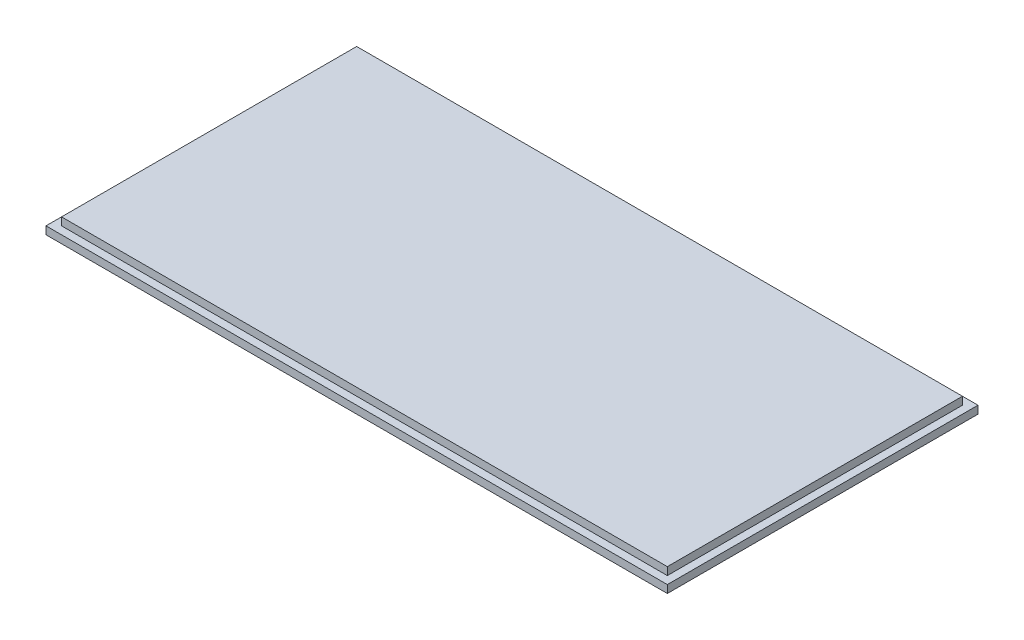
ISO-10303-21;
HEADER;
FILE_DESCRIPTION(('STEP AP214'),'2;1');
FILE_NAME('part.step','',(''),(''),'','','');
FILE_SCHEMA(('AUTOMOTIVE_DESIGN { 1 0 10303 214 1 1 1 1 }'));
ENDSEC;
DATA;
#1=APPLICATION_CONTEXT('core data for automotive mechanical design processes');
#2=APPLICATION_PROTOCOL_DEFINITION('international standard','automotive_design',2000,#1);
#3=PRODUCT_CONTEXT('',#1,'mechanical');
#4=PRODUCT('Part','Part','',(#3));
#5=PRODUCT_RELATED_PRODUCT_CATEGORY('part','',(#4));
#6=PRODUCT_DEFINITION_FORMATION('','',#4);
#7=PRODUCT_DEFINITION_CONTEXT('part definition',#1,'design');
#8=PRODUCT_DEFINITION('design','',#6,#7);
#9=PRODUCT_DEFINITION_SHAPE('','',#8);
#10=(LENGTH_UNIT() NAMED_UNIT(*) SI_UNIT(.MILLI.,.METRE.));
#11=(NAMED_UNIT(*) PLANE_ANGLE_UNIT() SI_UNIT($,.RADIAN.));
#12=(NAMED_UNIT(*) SI_UNIT($,.STERADIAN.) SOLID_ANGLE_UNIT());
#13=UNCERTAINTY_MEASURE_WITH_UNIT(LENGTH_MEASURE(1.E-05),#10,'distance_accuracy_value','');
#14=(GEOMETRIC_REPRESENTATION_CONTEXT(3) GLOBAL_UNCERTAINTY_ASSIGNED_CONTEXT((#13)) GLOBAL_UNIT_ASSIGNED_CONTEXT((#10,
#11,#12)) REPRESENTATION_CONTEXT('',''));
#15=CARTESIAN_POINT('',(0.,0.,0.));
#16=DIRECTION('',(0.,0.,1.));
#17=DIRECTION('',(1.,0.,0.));
#18=AXIS2_PLACEMENT_3D('',#15,#16,#17);
#19=CARTESIAN_POINT('',(60.,3.,-30.));
#20=DIRECTION('',(-1.,0.,0.));
#21=DIRECTION('',(0.,0.,1.));
#22=AXIS2_PLACEMENT_3D('',#19,#20,#21);
#23=PLANE('',#22);
#24=DIRECTION('',(0.,0.,-1.));
#25=VECTOR('',#24,1.);
#26=CARTESIAN_POINT('',(60.,1.5,-30.));
#27=LINE('',#26,#25);
#28=CARTESIAN_POINT('',(60.,1.5,30.));
#29=VERTEX_POINT('',#28);
#30=CARTESIAN_POINT('',(60.,1.5,-30.));
#31=VERTEX_POINT('',#30);
#32=EDGE_CURVE('E160',#29,#31,#27,.T.);
#33=ORIENTED_EDGE('',*,*,#32,.F.);
#34=DIRECTION('',(0.,-1.,0.));
#35=VECTOR('',#34,1.);
#36=CARTESIAN_POINT('',(60.,3.,30.));
#37=LINE('',#36,#35);
#38=CARTESIAN_POINT('',(60.,0.,30.));
#39=VERTEX_POINT('',#38);
#40=EDGE_CURVE('E179',#29,#39,#37,.T.);
#41=ORIENTED_EDGE('',*,*,#40,.T.);
#42=DIRECTION('',(0.,0.,-1.));
#43=VECTOR('',#42,1.);
#44=CARTESIAN_POINT('',(60.,0.,-30.));
#45=LINE('',#44,#43);
#46=CARTESIAN_POINT('',(60.,0.,-30.));
#47=VERTEX_POINT('',#46);
#48=EDGE_CURVE('E163',#39,#47,#45,.T.);
#49=ORIENTED_EDGE('',*,*,#48,.T.);
#50=DIRECTION('',(0.,-1.,0.));
#51=VECTOR('',#50,1.);
#52=CARTESIAN_POINT('',(60.,3.,-30.));
#53=LINE('',#52,#51);
#54=EDGE_CURVE('E47',#31,#47,#53,.T.);
#55=ORIENTED_EDGE('',*,*,#54,.F.);
#56=EDGE_LOOP('',(#33,#41,#49,#55));
#57=FACE_BOUND('',#56,.T.);
#58=ADVANCED_FACE('F39',(#57),#23,.F.);
#59=CARTESIAN_POINT('',(-60.,3.,-30.));
#60=DIRECTION('',(0.,0.,1.));
#61=DIRECTION('',(1.,0.,0.));
#62=AXIS2_PLACEMENT_3D('',#59,#60,#61);
#63=PLANE('',#62);
#64=DIRECTION('',(-1.,0.,0.));
#65=VECTOR('',#64,1.);
#66=CARTESIAN_POINT('',(-60.,1.5,-30.));
#67=LINE('',#66,#65);
#68=CARTESIAN_POINT('',(-60.,1.5,-30.));
#69=VERTEX_POINT('',#68);
#70=EDGE_CURVE('E157',#31,#69,#67,.T.);
#71=ORIENTED_EDGE('',*,*,#70,.F.);
#72=ORIENTED_EDGE('',*,*,#54,.T.);
#73=DIRECTION('',(-1.,0.,0.));
#74=VECTOR('',#73,1.);
#75=CARTESIAN_POINT('',(-60.,0.,-30.));
#76=LINE('',#75,#74);
#77=CARTESIAN_POINT('',(-60.,0.,-30.));
#78=VERTEX_POINT('',#77);
#79=EDGE_CURVE('E167',#47,#78,#76,.T.);
#80=ORIENTED_EDGE('',*,*,#79,.T.);
#81=DIRECTION('',(0.,-1.,0.));
#82=VECTOR('',#81,1.);
#83=CARTESIAN_POINT('',(-60.,3.,-30.));
#84=LINE('',#83,#82);
#85=EDGE_CURVE('E185',#69,#78,#84,.T.);
#86=ORIENTED_EDGE('',*,*,#85,.F.);
#87=EDGE_LOOP('',(#71,#72,#80,#86));
#88=FACE_BOUND('',#87,.T.);
#89=ADVANCED_FACE('F192',(#88),#63,.F.);
#90=CARTESIAN_POINT('',(-60.,3.,-30.));
#91=DIRECTION('',(1.,0.,0.));
#92=DIRECTION('',(0.,0.,-1.));
#93=AXIS2_PLACEMENT_3D('',#90,#91,#92);
#94=PLANE('',#93);
#95=DIRECTION('',(0.,0.,1.));
#96=VECTOR('',#95,1.);
#97=CARTESIAN_POINT('',(-60.,1.5,-30.));
#98=LINE('',#97,#96);
#99=CARTESIAN_POINT('',(-60.,1.5,30.));
#100=VERTEX_POINT('',#99);
#101=EDGE_CURVE('E53',#69,#100,#98,.T.);
#102=ORIENTED_EDGE('',*,*,#101,.F.);
#103=ORIENTED_EDGE('',*,*,#85,.T.);
#104=DIRECTION('',(0.,0.,1.));
#105=VECTOR('',#104,1.);
#106=CARTESIAN_POINT('',(-60.,0.,-30.));
#107=LINE('',#106,#105);
#108=CARTESIAN_POINT('',(-60.,0.,30.));
#109=VERTEX_POINT('',#108);
#110=EDGE_CURVE('E171',#78,#109,#107,.T.);
#111=ORIENTED_EDGE('',*,*,#110,.T.);
#112=DIRECTION('',(0.,-1.,0.));
#113=VECTOR('',#112,1.);
#114=CARTESIAN_POINT('',(-60.,3.,30.));
#115=LINE('',#114,#113);
#116=EDGE_CURVE('E182',#100,#109,#115,.T.);
#117=ORIENTED_EDGE('',*,*,#116,.F.);
#118=EDGE_LOOP('',(#102,#103,#111,#117));
#119=FACE_BOUND('',#118,.T.);
#120=ADVANCED_FACE('F206',(#119),#94,.F.);
#121=CARTESIAN_POINT('',(-60.,3.,30.));
#122=DIRECTION('',(0.,0.,-1.));
#123=DIRECTION('',(-1.,0.,0.));
#124=AXIS2_PLACEMENT_3D('',#121,#122,#123);
#125=PLANE('',#124);
#126=DIRECTION('',(1.,0.,0.));
#127=VECTOR('',#126,1.);
#128=CARTESIAN_POINT('',(-60.,1.5,30.));
#129=LINE('',#128,#127);
#130=EDGE_CURVE('E12',#100,#29,#129,.T.);
#131=ORIENTED_EDGE('',*,*,#130,.F.);
#132=ORIENTED_EDGE('',*,*,#116,.T.);
#133=DIRECTION('',(1.,0.,0.));
#134=VECTOR('',#133,1.);
#135=CARTESIAN_POINT('',(-60.,0.,30.));
#136=LINE('',#135,#134);
#137=EDGE_CURVE('E175',#109,#39,#136,.T.);
#138=ORIENTED_EDGE('',*,*,#137,.T.);
#139=ORIENTED_EDGE('',*,*,#40,.F.);
#140=EDGE_LOOP('',(#131,#132,#138,#139));
#141=FACE_BOUND('',#140,.T.);
#142=ADVANCED_FACE('F203',(#141),#125,.F.);
#143=CARTESIAN_POINT('',(0.,0.,0.));
#144=DIRECTION('',(0.,1.,0.));
#145=DIRECTION('',(0.,0.,1.));
#146=AXIS2_PLACEMENT_3D('',#143,#144,#145);
#147=PLANE('',#146);
#148=ORIENTED_EDGE('',*,*,#48,.F.);
#149=ORIENTED_EDGE('',*,*,#137,.F.);
#150=ORIENTED_EDGE('',*,*,#110,.F.);
#151=ORIENTED_EDGE('',*,*,#79,.F.);
#152=EDGE_LOOP('',(#148,#149,#150,#151));
#153=FACE_BOUND('',#152,.T.);
#154=ADVANCED_FACE('F199',(#153),#147,.F.);
#155=CARTESIAN_POINT('',(0.,1.5,0.));
#156=DIRECTION('',(0.,1.,0.));
#157=DIRECTION('',(0.,0.,1.));
#158=AXIS2_PLACEMENT_3D('',#155,#156,#157);
#159=PLANE('',#158);
#160=DIRECTION('',(1.,0.,0.));
#161=VECTOR('',#160,1.);
#162=CARTESIAN_POINT('',(-58.5,1.5,28.5));
#163=LINE('',#162,#161);
#164=CARTESIAN_POINT('',(-58.5,1.5,28.5));
#165=VERTEX_POINT('',#164);
#166=CARTESIAN_POINT('',(58.5,1.5,28.5));
#167=VERTEX_POINT('',#166);
#168=EDGE_CURVE('E116',#165,#167,#163,.T.);
#169=ORIENTED_EDGE('',*,*,#168,.F.);
#170=DIRECTION('',(0.,0.,1.));
#171=VECTOR('',#170,1.);
#172=CARTESIAN_POINT('',(-58.5,1.5,-28.5));
#173=LINE('',#172,#171);
#174=CARTESIAN_POINT('',(-58.5,1.5,-28.5));
#175=VERTEX_POINT('',#174);
#176=EDGE_CURVE('E125',#175,#165,#173,.T.);
#177=ORIENTED_EDGE('',*,*,#176,.F.);
#178=DIRECTION('',(-1.,0.,0.));
#179=VECTOR('',#178,1.);
#180=CARTESIAN_POINT('',(-58.5,1.5,-28.5));
#181=LINE('',#180,#179);
#182=CARTESIAN_POINT('',(58.5,1.5,-28.5));
#183=VERTEX_POINT('',#182);
#184=EDGE_CURVE('E107',#183,#175,#181,.T.);
#185=ORIENTED_EDGE('',*,*,#184,.F.);
#186=DIRECTION('',(0.,0.,-1.));
#187=VECTOR('',#186,1.);
#188=CARTESIAN_POINT('',(58.5,1.5,-28.5));
#189=LINE('',#188,#187);
#190=EDGE_CURVE('E122',#167,#183,#189,.T.);
#191=ORIENTED_EDGE('',*,*,#190,.F.);
#192=EDGE_LOOP('',(#169,#177,#185,#191));
#193=FACE_BOUND('',#192,.T.);
#194=ORIENTED_EDGE('',*,*,#32,.T.);
#195=ORIENTED_EDGE('',*,*,#70,.T.);
#196=ORIENTED_EDGE('',*,*,#101,.T.);
#197=ORIENTED_EDGE('',*,*,#130,.T.);
#198=EDGE_LOOP('',(#194,#195,#196,#197));
#199=FACE_BOUND('',#198,.T.);
#200=ADVANCED_FACE('F121',(#193,#199),#159,.T.);
#201=CARTESIAN_POINT('',(58.5,1.5,-28.5));
#202=DIRECTION('',(1.,0.,0.));
#203=DIRECTION('',(0.,0.,-1.));
#204=AXIS2_PLACEMENT_3D('',#201,#202,#203);
#205=PLANE('',#204);
#206=DIRECTION('',(0.,0.,-1.));
#207=VECTOR('',#206,1.);
#208=CARTESIAN_POINT('',(58.5,3.,-28.5));
#209=LINE('',#208,#207);
#210=CARTESIAN_POINT('',(58.5,3.,28.5));
#211=VERTEX_POINT('',#210);
#212=CARTESIAN_POINT('',(58.5,3.,-28.5));
#213=VERTEX_POINT('',#212);
#214=EDGE_CURVE('E141',#211,#213,#209,.T.);
#215=ORIENTED_EDGE('',*,*,#214,.F.);
#216=DIRECTION('',(0.,1.,0.));
#217=VECTOR('',#216,1.);
#218=CARTESIAN_POINT('',(58.5,1.5,28.5));
#219=LINE('',#218,#217);
#220=EDGE_CURVE('E129',#167,#211,#219,.T.);
#221=ORIENTED_EDGE('',*,*,#220,.F.);
#222=ORIENTED_EDGE('',*,*,#190,.T.);
#223=DIRECTION('',(0.,1.,0.));
#224=VECTOR('',#223,1.);
#225=CARTESIAN_POINT('',(58.5,1.5,-28.5));
#226=LINE('',#225,#224);
#227=EDGE_CURVE('E104',#183,#213,#226,.T.);
#228=ORIENTED_EDGE('',*,*,#227,.T.);
#229=EDGE_LOOP('',(#215,#221,#222,#228));
#230=FACE_BOUND('',#229,.T.);
#231=ADVANCED_FACE('F128',(#230),#205,.T.);
#232=CARTESIAN_POINT('',(-58.5,1.5,28.5));
#233=DIRECTION('',(0.,0.,1.));
#234=DIRECTION('',(1.,0.,0.));
#235=AXIS2_PLACEMENT_3D('',#232,#233,#234);
#236=PLANE('',#235);
#237=DIRECTION('',(1.,0.,0.));
#238=VECTOR('',#237,1.);
#239=CARTESIAN_POINT('',(-58.5,3.,28.5));
#240=LINE('',#239,#238);
#241=CARTESIAN_POINT('',(-58.5,3.,28.5));
#242=VERTEX_POINT('',#241);
#243=EDGE_CURVE('E131',#242,#211,#240,.T.);
#244=ORIENTED_EDGE('',*,*,#243,.F.);
#245=DIRECTION('',(0.,1.,0.));
#246=VECTOR('',#245,1.);
#247=CARTESIAN_POINT('',(-58.5,1.5,28.5));
#248=LINE('',#247,#246);
#249=EDGE_CURVE('E150',#165,#242,#248,.T.);
#250=ORIENTED_EDGE('',*,*,#249,.F.);
#251=ORIENTED_EDGE('',*,*,#168,.T.);
#252=ORIENTED_EDGE('',*,*,#220,.T.);
#253=EDGE_LOOP('',(#244,#250,#251,#252));
#254=FACE_BOUND('',#253,.T.);
#255=ADVANCED_FACE('F251',(#254),#236,.T.);
#256=CARTESIAN_POINT('',(-58.5,1.5,-28.5));
#257=DIRECTION('',(-1.,0.,0.));
#258=DIRECTION('',(0.,0.,1.));
#259=AXIS2_PLACEMENT_3D('',#256,#257,#258);
#260=PLANE('',#259);
#261=DIRECTION('',(0.,0.,1.));
#262=VECTOR('',#261,1.);
#263=CARTESIAN_POINT('',(-58.5,3.,-28.5));
#264=LINE('',#263,#262);
#265=CARTESIAN_POINT('',(-58.5,3.,-28.5));
#266=VERTEX_POINT('',#265);
#267=EDGE_CURVE('E61',#266,#242,#264,.T.);
#268=ORIENTED_EDGE('',*,*,#267,.F.);
#269=DIRECTION('',(0.,1.,0.));
#270=VECTOR('',#269,1.);
#271=CARTESIAN_POINT('',(-58.5,1.5,-28.5));
#272=LINE('',#271,#270);
#273=EDGE_CURVE('E115',#175,#266,#272,.T.);
#274=ORIENTED_EDGE('',*,*,#273,.F.);
#275=ORIENTED_EDGE('',*,*,#176,.T.);
#276=ORIENTED_EDGE('',*,*,#249,.T.);
#277=EDGE_LOOP('',(#268,#274,#275,#276));
#278=FACE_BOUND('',#277,.T.);
#279=ADVANCED_FACE('F260',(#278),#260,.T.);
#280=CARTESIAN_POINT('',(-58.5,1.5,-28.5));
#281=DIRECTION('',(0.,0.,-1.));
#282=DIRECTION('',(-1.,0.,0.));
#283=AXIS2_PLACEMENT_3D('',#280,#281,#282);
#284=PLANE('',#283);
#285=DIRECTION('',(-1.,0.,0.));
#286=VECTOR('',#285,1.);
#287=CARTESIAN_POINT('',(-58.5,3.,-28.5));
#288=LINE('',#287,#286);
#289=EDGE_CURVE('E109',#213,#266,#288,.T.);
#290=ORIENTED_EDGE('',*,*,#289,.F.);
#291=ORIENTED_EDGE('',*,*,#227,.F.);
#292=ORIENTED_EDGE('',*,*,#184,.T.);
#293=ORIENTED_EDGE('',*,*,#273,.T.);
#294=EDGE_LOOP('',(#290,#291,#292,#293));
#295=FACE_BOUND('',#294,.T.);
#296=ADVANCED_FACE('F106',(#295),#284,.T.);
#297=CARTESIAN_POINT('',(0.,3.,0.));
#298=DIRECTION('',(0.,1.,0.));
#299=DIRECTION('',(0.,0.,1.));
#300=AXIS2_PLACEMENT_3D('',#297,#298,#299);
#301=PLANE('',#300);
#302=ORIENTED_EDGE('',*,*,#243,.T.);
#303=ORIENTED_EDGE('',*,*,#214,.T.);
#304=ORIENTED_EDGE('',*,*,#289,.T.);
#305=ORIENTED_EDGE('',*,*,#267,.T.);
#306=EDGE_LOOP('',(#302,#303,#304,#305));
#307=FACE_BOUND('',#306,.T.);
#308=ADVANCED_FACE('F278',(#307),#301,.T.);
#309=CLOSED_SHELL('',(#58,#89,#120,#142,#154,#200,#231,#255,#279,#296,#308));
#310=MANIFOLD_SOLID_BREP('B2',#309);
#311=ADVANCED_BREP_SHAPE_REPRESENTATION('',(#18,#310),#14);
#312=SHAPE_DEFINITION_REPRESENTATION(#9,#311);
ENDSEC;
END-ISO-10303-21;
